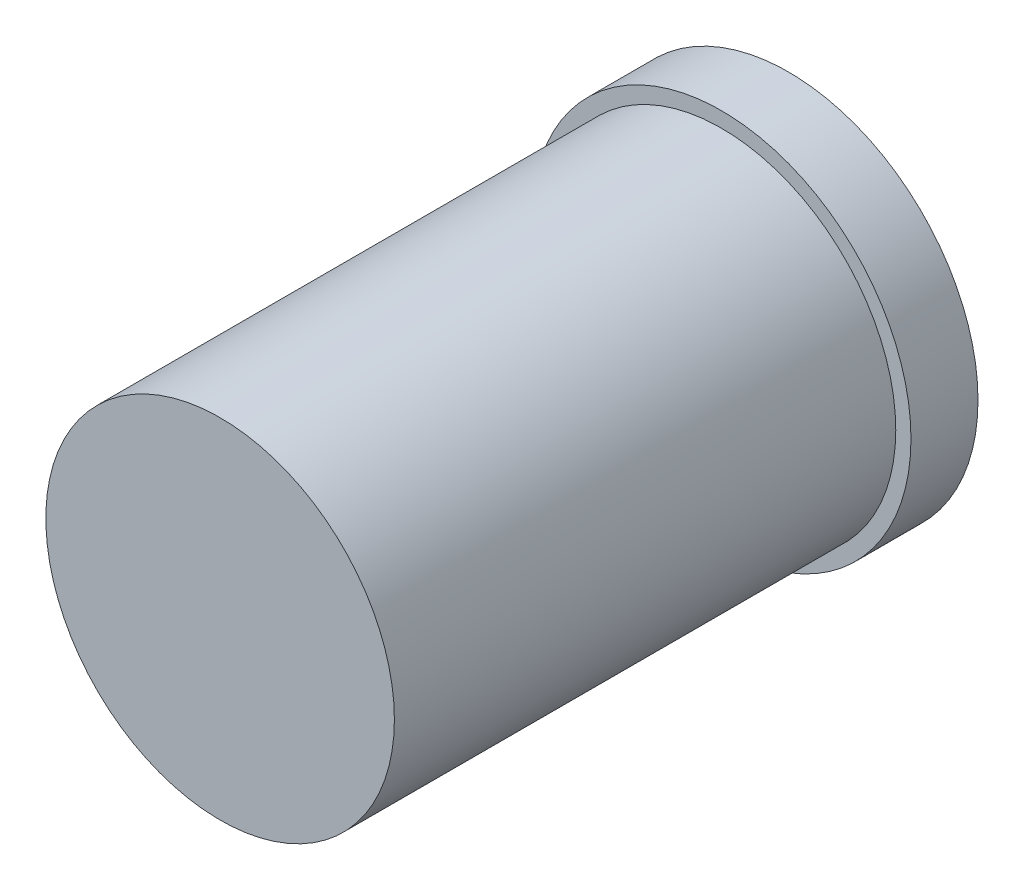
ISO-10303-21;
HEADER;
FILE_DESCRIPTION(('STEP AP214'),'2;1');
FILE_NAME('part.step','',(''),(''),'','','');
FILE_SCHEMA(('AUTOMOTIVE_DESIGN { 1 0 10303 214 1 1 1 1 }'));
ENDSEC;
DATA;
#1=APPLICATION_CONTEXT('core data for automotive mechanical design processes');
#2=APPLICATION_PROTOCOL_DEFINITION('international standard','automotive_design',2000,#1);
#3=PRODUCT_CONTEXT('',#1,'mechanical');
#4=PRODUCT('Part','Part','',(#3));
#5=PRODUCT_RELATED_PRODUCT_CATEGORY('part','',(#4));
#6=PRODUCT_DEFINITION_FORMATION('','',#4);
#7=PRODUCT_DEFINITION_CONTEXT('part definition',#1,'design');
#8=PRODUCT_DEFINITION('design','',#6,#7);
#9=PRODUCT_DEFINITION_SHAPE('','',#8);
#10=(LENGTH_UNIT() NAMED_UNIT(*) SI_UNIT(.MILLI.,.METRE.));
#11=(NAMED_UNIT(*) PLANE_ANGLE_UNIT() SI_UNIT($,.RADIAN.));
#12=(NAMED_UNIT(*) SI_UNIT($,.STERADIAN.) SOLID_ANGLE_UNIT());
#13=UNCERTAINTY_MEASURE_WITH_UNIT(LENGTH_MEASURE(1.E-05),#10,'distance_accuracy_value','');
#14=(GEOMETRIC_REPRESENTATION_CONTEXT(3) GLOBAL_UNCERTAINTY_ASSIGNED_CONTEXT((#13)) GLOBAL_UNIT_ASSIGNED_CONTEXT((#10,
#11,#12)) REPRESENTATION_CONTEXT('',''));
#15=CARTESIAN_POINT('',(0.,0.,0.));
#16=DIRECTION('',(0.,0.,1.));
#17=DIRECTION('',(1.,0.,0.));
#18=AXIS2_PLACEMENT_3D('',#15,#16,#17);
#19=CARTESIAN_POINT('',(0.,0.,7.1247));
#20=DIRECTION('',(0.,0.,-1.));
#21=DIRECTION('',(-1.,0.,0.));
#22=AXIS2_PLACEMENT_3D('',#19,#20,#21);
#23=CYLINDRICAL_SURFACE('',#22,2.4765);
#24=CARTESIAN_POINT('',(0.,0.,7.1247));
#25=DIRECTION('',(0.,0.,1.));
#26=DIRECTION('',(1.,0.,0.));
#27=AXIS2_PLACEMENT_3D('',#24,#25,#26);
#28=CIRCLE('',#27,2.4765);
#29=CARTESIAN_POINT('',(2.4765,0.,7.1247));
#30=VERTEX_POINT('',#29);
#31=EDGE_CURVE('E10',#30,#30,#28,.T.);
#32=ORIENTED_EDGE('',*,*,#31,.F.);
#33=EDGE_LOOP('',(#32));
#34=FACE_BOUND('',#33,.T.);
#35=CARTESIAN_POINT('',(0.,0.,0.));
#36=DIRECTION('',(0.,0.,1.));
#37=DIRECTION('',(1.,0.,0.));
#38=AXIS2_PLACEMENT_3D('',#35,#36,#37);
#39=CIRCLE('',#38,2.4765);
#40=CARTESIAN_POINT('',(2.4765,0.,0.));
#41=VERTEX_POINT('',#40);
#42=EDGE_CURVE('E34',#41,#41,#39,.T.);
#43=ORIENTED_EDGE('',*,*,#42,.T.);
#44=EDGE_LOOP('',(#43));
#45=FACE_BOUND('',#44,.T.);
#46=ADVANCED_FACE('F31',(#34,#45),#23,.T.);
#47=CARTESIAN_POINT('',(0.,0.,7.1247));
#48=DIRECTION('',(0.,0.,1.));
#49=DIRECTION('',(1.,0.,0.));
#50=AXIS2_PLACEMENT_3D('',#47,#48,#49);
#51=PLANE('',#50);
#52=ORIENTED_EDGE('',*,*,#31,.T.);
#53=EDGE_LOOP('',(#52));
#54=FACE_BOUND('',#53,.T.);
#55=ADVANCED_FACE('F54',(#54),#51,.T.);
#56=CARTESIAN_POINT('',(0.,0.,-0.9525));
#57=DIRECTION('',(0.,0.,1.));
#58=DIRECTION('',(1.,0.,0.));
#59=AXIS2_PLACEMENT_3D('',#56,#57,#58);
#60=CYLINDRICAL_SURFACE('',#59,2.6924);
#61=CARTESIAN_POINT('',(0.,0.,-0.9525));
#62=DIRECTION('',(0.,0.,-1.));
#63=DIRECTION('',(-1.,0.,0.));
#64=AXIS2_PLACEMENT_3D('',#61,#62,#63);
#65=CIRCLE('',#64,2.6924);
#66=CARTESIAN_POINT('',(-2.6924,0.,-0.9525));
#67=VERTEX_POINT('',#66);
#68=EDGE_CURVE('E41',#67,#67,#65,.T.);
#69=ORIENTED_EDGE('',*,*,#68,.F.);
#70=EDGE_LOOP('',(#69));
#71=FACE_BOUND('',#70,.T.);
#72=CARTESIAN_POINT('',(0.,0.,0.));
#73=DIRECTION('',(0.,0.,-1.));
#74=DIRECTION('',(-1.,0.,0.));
#75=AXIS2_PLACEMENT_3D('',#72,#73,#74);
#76=CIRCLE('',#75,2.6924);
#77=CARTESIAN_POINT('',(-2.6924,0.,0.));
#78=VERTEX_POINT('',#77);
#79=EDGE_CURVE('E43',#78,#78,#76,.T.);
#80=ORIENTED_EDGE('',*,*,#79,.T.);
#81=EDGE_LOOP('',(#80));
#82=FACE_BOUND('',#81,.T.);
#83=ADVANCED_FACE('F51',(#71,#82),#60,.T.);
#84=CARTESIAN_POINT('',(0.,0.,-0.9525));
#85=DIRECTION('',(0.,0.,-1.));
#86=DIRECTION('',(-1.,0.,0.));
#87=AXIS2_PLACEMENT_3D('',#84,#85,#86);
#88=PLANE('',#87);
#89=ORIENTED_EDGE('',*,*,#68,.T.);
#90=EDGE_LOOP('',(#89));
#91=FACE_BOUND('',#90,.T.);
#92=ADVANCED_FACE('F49',(#91),#88,.T.);
#93=CARTESIAN_POINT('',(0.,0.,0.));
#94=DIRECTION('',(0.,0.,-1.));
#95=DIRECTION('',(-1.,0.,0.));
#96=AXIS2_PLACEMENT_3D('',#93,#94,#95);
#97=PLANE('',#96);
#98=ORIENTED_EDGE('',*,*,#42,.F.);
#99=EDGE_LOOP('',(#98));
#100=FACE_BOUND('',#99,.T.);
#101=ORIENTED_EDGE('',*,*,#79,.F.);
#102=EDGE_LOOP('',(#101));
#103=FACE_BOUND('',#102,.T.);
#104=ADVANCED_FACE('F58',(#100,#103),#97,.F.);
#105=CLOSED_SHELL('',(#46,#55,#83,#92,#104));
#106=MANIFOLD_SOLID_BREP('B2',#105);
#107=ADVANCED_BREP_SHAPE_REPRESENTATION('',(#18,#106),#14);
#108=SHAPE_DEFINITION_REPRESENTATION(#9,#107);
ENDSEC;
END-ISO-10303-21;
